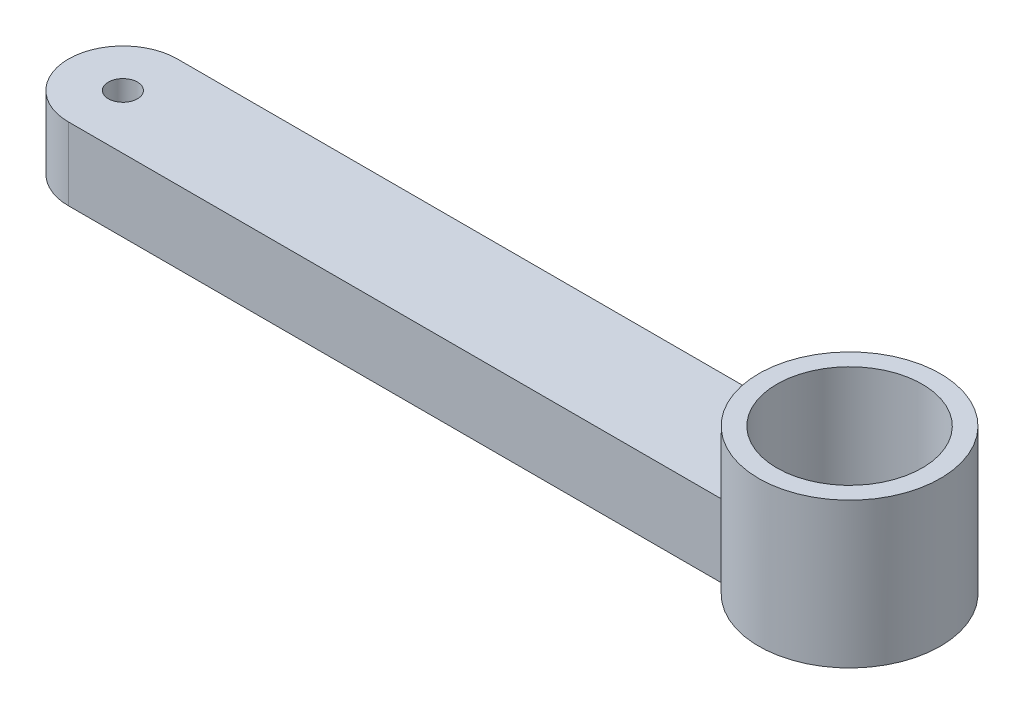
ISO-10303-21;
HEADER;
FILE_DESCRIPTION(('STEP AP214'),'2;1');
FILE_NAME('part.step','',(''),(''),'','','');
FILE_SCHEMA(('AUTOMOTIVE_DESIGN { 1 0 10303 214 1 1 1 1 }'));
ENDSEC;
DATA;
#1=APPLICATION_CONTEXT('core data for automotive mechanical design processes');
#2=APPLICATION_PROTOCOL_DEFINITION('international standard','automotive_design',2000,#1);
#3=PRODUCT_CONTEXT('',#1,'mechanical');
#4=PRODUCT('Part','Part','',(#3));
#5=PRODUCT_RELATED_PRODUCT_CATEGORY('part','',(#4));
#6=PRODUCT_DEFINITION_FORMATION('','',#4);
#7=PRODUCT_DEFINITION_CONTEXT('part definition',#1,'design');
#8=PRODUCT_DEFINITION('design','',#6,#7);
#9=PRODUCT_DEFINITION_SHAPE('','',#8);
#10=(LENGTH_UNIT() NAMED_UNIT(*) SI_UNIT(.MILLI.,.METRE.));
#11=(NAMED_UNIT(*) PLANE_ANGLE_UNIT() SI_UNIT($,.RADIAN.));
#12=(NAMED_UNIT(*) SI_UNIT($,.STERADIAN.) SOLID_ANGLE_UNIT());
#13=UNCERTAINTY_MEASURE_WITH_UNIT(LENGTH_MEASURE(1.E-05),#10,'distance_accuracy_value','');
#14=(GEOMETRIC_REPRESENTATION_CONTEXT(3) GLOBAL_UNCERTAINTY_ASSIGNED_CONTEXT((#13)) GLOBAL_UNIT_ASSIGNED_CONTEXT((#10,
#11,#12)) REPRESENTATION_CONTEXT('',''));
#15=CARTESIAN_POINT('',(0.,0.,0.));
#16=DIRECTION('',(0.,0.,1.));
#17=DIRECTION('',(1.,0.,0.));
#18=AXIS2_PLACEMENT_3D('',#15,#16,#17);
#19=CARTESIAN_POINT('',(0.,10.,7.5));
#20=DIRECTION('',(0.,0.,-1.));
#21=DIRECTION('',(-1.,0.,0.));
#22=AXIS2_PLACEMENT_3D('',#19,#20,#21);
#23=PLANE('',#22);
#24=DIRECTION('',(0.,-1.,0.));
#25=VECTOR('',#24,1.);
#26=CARTESIAN_POINT('',(90.,20.,7.5));
#27=LINE('',#26,#25);
#28=CARTESIAN_POINT('',(90.,10.,7.5));
#29=VERTEX_POINT('',#28);
#30=CARTESIAN_POINT('',(90.,0.,7.5));
#31=VERTEX_POINT('',#30);
#32=EDGE_CURVE('E52',#29,#31,#27,.T.);
#33=ORIENTED_EDGE('',*,*,#32,.F.);
#34=DIRECTION('',(1.,0.,0.));
#35=VECTOR('',#34,1.);
#36=CARTESIAN_POINT('',(0.,10.,7.5));
#37=LINE('',#36,#35);
#38=CARTESIAN_POINT('',(0.,10.,7.5));
#39=VERTEX_POINT('',#38);
#40=EDGE_CURVE('E115',#39,#29,#37,.T.);
#41=ORIENTED_EDGE('',*,*,#40,.F.);
#42=DIRECTION('',(0.,-1.,0.));
#43=VECTOR('',#42,1.);
#44=CARTESIAN_POINT('',(0.,10.,7.5));
#45=LINE('',#44,#43);
#46=CARTESIAN_POINT('',(0.,0.,7.5));
#47=VERTEX_POINT('',#46);
#48=EDGE_CURVE('E45',#39,#47,#45,.T.);
#49=ORIENTED_EDGE('',*,*,#48,.T.);
#50=DIRECTION('',(1.,0.,0.));
#51=VECTOR('',#50,1.);
#52=CARTESIAN_POINT('',(0.,0.,7.5));
#53=LINE('',#52,#51);
#54=EDGE_CURVE('E57',#47,#31,#53,.T.);
#55=ORIENTED_EDGE('',*,*,#54,.T.);
#56=EDGE_LOOP('',(#33,#41,#49,#55));
#57=FACE_BOUND('',#56,.T.);
#58=ADVANCED_FACE('F37',(#57),#23,.F.);
#59=CARTESIAN_POINT('',(0.,10.,-7.5));
#60=DIRECTION('',(0.,0.,1.));
#61=DIRECTION('',(1.,0.,0.));
#62=AXIS2_PLACEMENT_3D('',#59,#60,#61);
#63=PLANE('',#62);
#64=DIRECTION('',(0.,-1.,0.));
#65=VECTOR('',#64,1.);
#66=CARTESIAN_POINT('',(90.,20.,-7.5));
#67=LINE('',#66,#65);
#68=CARTESIAN_POINT('',(90.,0.,-7.5));
#69=VERTEX_POINT('',#68);
#70=CARTESIAN_POINT('',(90.,10.,-7.5));
#71=VERTEX_POINT('',#70);
#72=EDGE_CURVE('E11',#69,#71,#67,.F.);
#73=ORIENTED_EDGE('',*,*,#72,.F.);
#74=DIRECTION('',(-1.,0.,0.));
#75=VECTOR('',#74,1.);
#76=CARTESIAN_POINT('',(0.,0.,-7.5));
#77=LINE('',#76,#75);
#78=CARTESIAN_POINT('',(0.,0.,-7.5));
#79=VERTEX_POINT('',#78);
#80=EDGE_CURVE('E76',#69,#79,#77,.T.);
#81=ORIENTED_EDGE('',*,*,#80,.T.);
#82=DIRECTION('',(0.,-1.,0.));
#83=VECTOR('',#82,1.);
#84=CARTESIAN_POINT('',(0.,10.,-7.5));
#85=LINE('',#84,#83);
#86=CARTESIAN_POINT('',(0.,10.,-7.5));
#87=VERTEX_POINT('',#86);
#88=EDGE_CURVE('E118',#87,#79,#85,.T.);
#89=ORIENTED_EDGE('',*,*,#88,.F.);
#90=DIRECTION('',(-1.,0.,0.));
#91=VECTOR('',#90,1.);
#92=CARTESIAN_POINT('',(0.,10.,-7.5));
#93=LINE('',#92,#91);
#94=EDGE_CURVE('E91',#71,#87,#93,.T.);
#95=ORIENTED_EDGE('',*,*,#94,.F.);
#96=EDGE_LOOP('',(#73,#81,#89,#95));
#97=FACE_BOUND('',#96,.T.);
#98=ADVANCED_FACE('F90',(#97),#63,.F.);
#99=CARTESIAN_POINT('',(0.,10.,0.));
#100=DIRECTION('',(0.,1.,0.));
#101=DIRECTION('',(0.,0.,1.));
#102=AXIS2_PLACEMENT_3D('',#99,#100,#101);
#103=PLANE('',#102);
#104=CARTESIAN_POINT('',(0.,10.,0.));
#105=DIRECTION('',(0.,1.,0.));
#106=DIRECTION('',(0.,0.,1.));
#107=AXIS2_PLACEMENT_3D('',#104,#105,#106);
#108=CIRCLE('',#107,2.);
#109=CARTESIAN_POINT('',(0.,10.,2.));
#110=VERTEX_POINT('',#109);
#111=EDGE_CURVE('E108',#110,#110,#108,.T.);
#112=ORIENTED_EDGE('',*,*,#111,.F.);
#113=EDGE_LOOP('',(#112));
#114=FACE_BOUND('',#113,.T.);
#115=ORIENTED_EDGE('',*,*,#40,.T.);
#116=CARTESIAN_POINT('',(100.,10.,0.));
#117=DIRECTION('',(0.,1.,0.));
#118=DIRECTION('',(0.,0.,1.));
#119=AXIS2_PLACEMENT_3D('',#116,#117,#118);
#120=CIRCLE('',#119,12.5);
#121=EDGE_CURVE('E99',#29,#71,#120,.F.);
#122=ORIENTED_EDGE('',*,*,#121,.T.);
#123=ORIENTED_EDGE('',*,*,#94,.T.);
#124=CARTESIAN_POINT('',(0.,10.,0.));
#125=DIRECTION('',(0.,1.,0.));
#126=DIRECTION('',(0.,0.,1.));
#127=AXIS2_PLACEMENT_3D('',#124,#125,#126);
#128=CIRCLE('',#127,7.5);
#129=EDGE_CURVE('E87',#87,#39,#128,.T.);
#130=ORIENTED_EDGE('',*,*,#129,.T.);
#131=EDGE_LOOP('',(#115,#122,#123,#130));
#132=FACE_BOUND('',#131,.T.);
#133=ADVANCED_FACE('F125',(#114,#132),#103,.T.);
#134=CARTESIAN_POINT('',(0.,0.,0.));
#135=DIRECTION('',(0.,1.,0.));
#136=DIRECTION('',(0.,0.,1.));
#137=AXIS2_PLACEMENT_3D('',#134,#135,#136);
#138=PLANE('',#137);
#139=CARTESIAN_POINT('',(100.,0.,0.));
#140=DIRECTION('',(0.,1.,0.));
#141=DIRECTION('',(0.,0.,1.));
#142=AXIS2_PLACEMENT_3D('',#139,#140,#141);
#143=CIRCLE('',#142,9.99999999999999);
#144=CARTESIAN_POINT('',(100.,0.,9.99999999999999));
#145=VERTEX_POINT('',#144);
#146=EDGE_CURVE('E96',#145,#145,#143,.F.);
#147=ORIENTED_EDGE('',*,*,#146,.F.);
#148=EDGE_LOOP('',(#147));
#149=FACE_BOUND('',#148,.T.);
#150=ORIENTED_EDGE('',*,*,#80,.F.);
#151=CARTESIAN_POINT('',(100.,0.,0.));
#152=DIRECTION('',(0.,1.,0.));
#153=DIRECTION('',(0.,0.,1.));
#154=AXIS2_PLACEMENT_3D('',#151,#152,#153);
#155=CIRCLE('',#154,12.5);
#156=EDGE_CURVE('E81',#31,#69,#155,.T.);
#157=ORIENTED_EDGE('',*,*,#156,.F.);
#158=ORIENTED_EDGE('',*,*,#54,.F.);
#159=CARTESIAN_POINT('',(0.,0.,0.));
#160=DIRECTION('',(0.,1.,0.));
#161=DIRECTION('',(0.,0.,1.));
#162=AXIS2_PLACEMENT_3D('',#159,#160,#161);
#163=CIRCLE('',#162,7.5);
#164=EDGE_CURVE('E83',#79,#47,#163,.T.);
#165=ORIENTED_EDGE('',*,*,#164,.F.);
#166=EDGE_LOOP('',(#150,#157,#158,#165));
#167=FACE_BOUND('',#166,.T.);
#168=CARTESIAN_POINT('',(0.,0.,0.));
#169=DIRECTION('',(0.,1.,0.));
#170=DIRECTION('',(0.,0.,1.));
#171=AXIS2_PLACEMENT_3D('',#168,#169,#170);
#172=CIRCLE('',#171,2.);
#173=CARTESIAN_POINT('',(0.,0.,2.));
#174=VERTEX_POINT('',#173);
#175=EDGE_CURVE('E107',#174,#174,#172,.T.);
#176=ORIENTED_EDGE('',*,*,#175,.T.);
#177=EDGE_LOOP('',(#176));
#178=FACE_BOUND('',#177,.T.);
#179=ADVANCED_FACE('F78',(#149,#167,#178),#138,.F.);
#180=CARTESIAN_POINT('',(0.,10.,0.));
#181=DIRECTION('',(0.,-1.,0.));
#182=DIRECTION('',(0.,0.,-1.));
#183=AXIS2_PLACEMENT_3D('',#180,#181,#182);
#184=CYLINDRICAL_SURFACE('',#183,7.5);
#185=ORIENTED_EDGE('',*,*,#164,.T.);
#186=ORIENTED_EDGE('',*,*,#48,.F.);
#187=ORIENTED_EDGE('',*,*,#129,.F.);
#188=ORIENTED_EDGE('',*,*,#88,.T.);
#189=EDGE_LOOP('',(#185,#186,#187,#188));
#190=FACE_BOUND('',#189,.T.);
#191=ADVANCED_FACE('F39',(#190),#184,.T.);
#192=CARTESIAN_POINT('',(0.,10.,0.));
#193=DIRECTION('',(0.,-1.,0.));
#194=DIRECTION('',(0.,0.,-1.));
#195=AXIS2_PLACEMENT_3D('',#192,#193,#194);
#196=CYLINDRICAL_SURFACE('',#195,2.);
#197=ORIENTED_EDGE('',*,*,#111,.T.);
#198=EDGE_LOOP('',(#197));
#199=FACE_BOUND('',#198,.T.);
#200=ORIENTED_EDGE('',*,*,#175,.F.);
#201=EDGE_LOOP('',(#200));
#202=FACE_BOUND('',#201,.T.);
#203=ADVANCED_FACE('F162',(#199,#202),#196,.F.);
#204=CARTESIAN_POINT('',(100.,20.,0.));
#205=DIRECTION('',(0.,-1.,0.));
#206=DIRECTION('',(0.,0.,-1.));
#207=AXIS2_PLACEMENT_3D('',#204,#205,#206);
#208=CYLINDRICAL_SURFACE('',#207,12.5);
#209=CARTESIAN_POINT('',(100.,20.,0.));
#210=DIRECTION('',(0.,1.,0.));
#211=DIRECTION('',(0.,0.,1.));
#212=AXIS2_PLACEMENT_3D('',#209,#210,#211);
#213=CIRCLE('',#212,12.5);
#214=CARTESIAN_POINT('',(100.,20.,12.5));
#215=VERTEX_POINT('',#214);
#216=EDGE_CURVE('E95',#215,#215,#213,.T.);
#217=ORIENTED_EDGE('',*,*,#216,.F.);
#218=EDGE_LOOP('',(#217));
#219=FACE_BOUND('',#218,.T.);
#220=ORIENTED_EDGE('',*,*,#121,.F.);
#221=ORIENTED_EDGE('',*,*,#32,.T.);
#222=ORIENTED_EDGE('',*,*,#156,.T.);
#223=ORIENTED_EDGE('',*,*,#72,.T.);
#224=EDGE_LOOP('',(#220,#221,#222,#223));
#225=FACE_BOUND('',#224,.T.);
#226=ADVANCED_FACE('F94',(#219,#225),#208,.T.);
#227=CARTESIAN_POINT('',(100.,20.,0.));
#228=DIRECTION('',(0.,1.,0.));
#229=DIRECTION('',(0.,0.,1.));
#230=AXIS2_PLACEMENT_3D('',#227,#228,#229);
#231=PLANE('',#230);
#232=CARTESIAN_POINT('',(100.,20.,0.));
#233=DIRECTION('',(0.,1.,0.));
#234=DIRECTION('',(0.,0.,1.));
#235=AXIS2_PLACEMENT_3D('',#232,#233,#234);
#236=CIRCLE('',#235,9.99999999999999);
#237=CARTESIAN_POINT('',(100.,20.,9.99999999999999));
#238=VERTEX_POINT('',#237);
#239=EDGE_CURVE('E102',#238,#238,#236,.T.);
#240=ORIENTED_EDGE('',*,*,#239,.F.);
#241=EDGE_LOOP('',(#240));
#242=FACE_BOUND('',#241,.T.);
#243=ORIENTED_EDGE('',*,*,#216,.T.);
#244=EDGE_LOOP('',(#243));
#245=FACE_BOUND('',#244,.T.);
#246=ADVANCED_FACE('F161',(#242,#245),#231,.T.);
#247=CARTESIAN_POINT('',(100.,-0.001000000000001,0.));
#248=DIRECTION('',(0.,1.,0.));
#249=DIRECTION('',(0.,0.,1.));
#250=AXIS2_PLACEMENT_3D('',#247,#248,#249);
#251=CYLINDRICAL_SURFACE('',#250,9.99999999999999);
#252=ORIENTED_EDGE('',*,*,#239,.T.);
#253=EDGE_LOOP('',(#252));
#254=FACE_BOUND('',#253,.T.);
#255=ORIENTED_EDGE('',*,*,#146,.T.);
#256=EDGE_LOOP('',(#255));
#257=FACE_BOUND('',#256,.T.);
#258=ADVANCED_FACE('F180',(#254,#257),#251,.F.);
#259=CLOSED_SHELL('',(#58,#98,#133,#179,#191,#203,#226,#246,#258));
#260=MANIFOLD_SOLID_BREP('B2',#259);
#261=ADVANCED_BREP_SHAPE_REPRESENTATION('',(#18,#260),#14);
#262=SHAPE_DEFINITION_REPRESENTATION(#9,#261);
ENDSEC;
END-ISO-10303-21;
